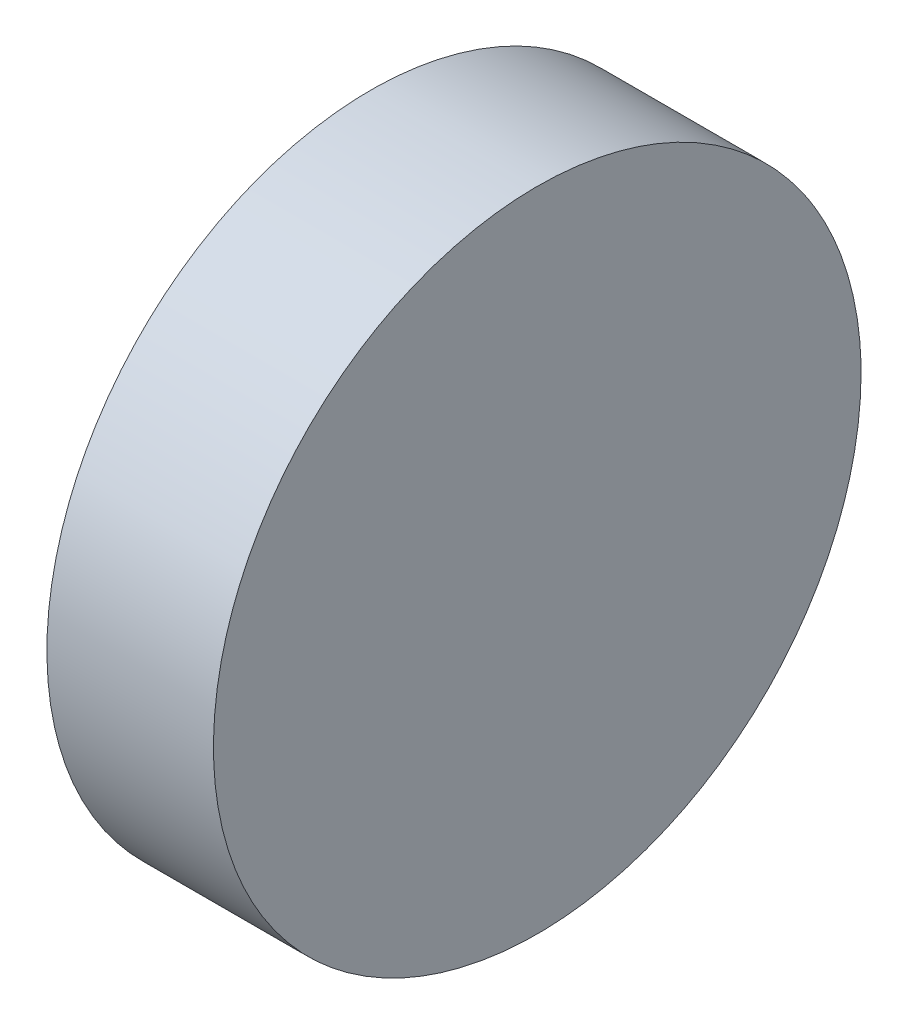
ISO-10303-21;
HEADER;
FILE_DESCRIPTION(('STEP AP214'),'2;1');
FILE_NAME('part.step','',(''),(''),'','','');
FILE_SCHEMA(('AUTOMOTIVE_DESIGN { 1 0 10303 214 1 1 1 1 }'));
ENDSEC;
DATA;
#1=APPLICATION_CONTEXT('core data for automotive mechanical design processes');
#2=APPLICATION_PROTOCOL_DEFINITION('international standard','automotive_design',2000,#1);
#3=PRODUCT_CONTEXT('',#1,'mechanical');
#4=PRODUCT('Part','Part','',(#3));
#5=PRODUCT_RELATED_PRODUCT_CATEGORY('part','',(#4));
#6=PRODUCT_DEFINITION_FORMATION('','',#4);
#7=PRODUCT_DEFINITION_CONTEXT('part definition',#1,'design');
#8=PRODUCT_DEFINITION('design','',#6,#7);
#9=PRODUCT_DEFINITION_SHAPE('','',#8);
#10=(LENGTH_UNIT() NAMED_UNIT(*) SI_UNIT(.MILLI.,.METRE.));
#11=(NAMED_UNIT(*) PLANE_ANGLE_UNIT() SI_UNIT($,.RADIAN.));
#12=(NAMED_UNIT(*) SI_UNIT($,.STERADIAN.) SOLID_ANGLE_UNIT());
#13=UNCERTAINTY_MEASURE_WITH_UNIT(LENGTH_MEASURE(1.E-05),#10,'distance_accuracy_value','');
#14=(GEOMETRIC_REPRESENTATION_CONTEXT(3) GLOBAL_UNCERTAINTY_ASSIGNED_CONTEXT((#13)) GLOBAL_UNIT_ASSIGNED_CONTEXT((#10,
#11,#12)) REPRESENTATION_CONTEXT('',''));
#15=CARTESIAN_POINT('',(0.,0.,0.));
#16=DIRECTION('',(0.,0.,1.));
#17=DIRECTION('',(1.,0.,0.));
#18=AXIS2_PLACEMENT_3D('',#15,#16,#17);
#19=CARTESIAN_POINT('',(24.3378726721836,4.,-17.2853553390593));
#20=CARTESIAN_POINT('',(24.3378726721836,4.16822997920764,-17.2853553390593));
#21=CARTESIAN_POINT('',(24.3378726721836,4.50468993762291,-17.2184292922025));
#22=CARTESIAN_POINT('',(24.3378726721836,4.93254540726843,-16.9325454072684));
#23=CARTESIAN_POINT('',(24.3378726721836,5.21842929220248,-16.5046899376229));
#24=CARTESIAN_POINT('',(24.3378726721836,5.31881836248775,-16.));
#25=CARTESIAN_POINT('',(24.3378726721836,5.21842929220248,-15.4953100623771));
#26=CARTESIAN_POINT('',(24.3378726721836,4.93254540726842,-15.0674545927316));
#27=CARTESIAN_POINT('',(24.3378726721836,4.50468993762291,-14.7815707077975));
#28=CARTESIAN_POINT('',(24.3378726721836,4.,-14.6811816375123));
#29=CARTESIAN_POINT('',(24.3378726721836,3.49531006237708,-14.7815707077975));
#30=CARTESIAN_POINT('',(24.3378726721836,3.06745459273157,-15.0674545927316));
#31=CARTESIAN_POINT('',(24.3378726721836,2.78157070779752,-15.4953100623771));
#32=CARTESIAN_POINT('',(24.3378726721836,2.68118163751224,-16.));
#33=CARTESIAN_POINT('',(24.3378726721836,2.78157070779752,-16.5046899376229));
#34=CARTESIAN_POINT('',(24.3378726721836,3.06745459273157,-16.9325454072684));
#35=CARTESIAN_POINT('',(24.3378726721836,3.49531006237708,-17.2184292922025));
#36=CARTESIAN_POINT('',(24.3378726721836,3.83177002079236,-17.2853553390593));
#37=CARTESIAN_POINT('',(24.3378726721836,4.,-17.2853553390593));
#38=B_SPLINE_CURVE_WITH_KNOTS('',3,(#19,#20,#21,#22,#23,#24,#25,#26,#27,#28,#29,#30,#31,#32,#33,
#34,#35,#36,#37),.UNSPECIFIED.,.T.,.F.,(4,1,1,1,1,1,1,1,1,1,1,1,1,1,1,1,4),(0.,
0.0624999999999996,0.125,0.1875,0.25,0.3125,0.375,0.4375,0.5,0.562499999999999,0.625,0.6875,
0.75,0.8125,0.875,0.937499999999999,1.),.UNSPECIFIED.);
#39=DIRECTION('',(1.,0.,0.));
#40=VECTOR('',#39,1.);
#41=SURFACE_OF_LINEAR_EXTRUSION('',#38,#40);
#42=CARTESIAN_POINT('',(24.3378726721836,4.,-17.2853553390593));
#43=CARTESIAN_POINT('',(24.3378726721836,4.16822997920764,-17.2853553390593));
#44=CARTESIAN_POINT('',(24.3378726721836,4.50468993762291,-17.2184292922025));
#45=CARTESIAN_POINT('',(24.3378726721836,4.93254540726843,-16.9325454072684));
#46=CARTESIAN_POINT('',(24.3378726721836,5.21842929220248,-16.5046899376229));
#47=CARTESIAN_POINT('',(24.3378726721836,5.31881836248775,-16.));
#48=CARTESIAN_POINT('',(24.3378726721836,5.21842929220248,-15.4953100623771));
#49=CARTESIAN_POINT('',(24.3378726721836,4.93254540726842,-15.0674545927316));
#50=CARTESIAN_POINT('',(24.3378726721836,4.50468993762291,-14.7815707077975));
#51=CARTESIAN_POINT('',(24.3378726721836,4.,-14.6811816375123));
#52=CARTESIAN_POINT('',(24.3378726721836,3.49531006237708,-14.7815707077975));
#53=CARTESIAN_POINT('',(24.3378726721836,3.06745459273157,-15.0674545927316));
#54=CARTESIAN_POINT('',(24.3378726721836,2.78157070779752,-15.4953100623771));
#55=CARTESIAN_POINT('',(24.3378726721836,2.68118163751224,-16.));
#56=CARTESIAN_POINT('',(24.3378726721836,2.78157070779752,-16.5046899376229));
#57=CARTESIAN_POINT('',(24.3378726721836,3.06745459273157,-16.9325454072684));
#58=CARTESIAN_POINT('',(24.3378726721836,3.49531006237708,-17.2184292922025));
#59=CARTESIAN_POINT('',(24.3378726721836,3.83177002079236,-17.2853553390593));
#60=CARTESIAN_POINT('',(24.3378726721836,4.,-17.2853553390593));
#61=B_SPLINE_CURVE_WITH_KNOTS('',3,(#42,#43,#44,#45,#46,#47,#48,#49,#50,#51,#52,#53,#54,#55,#56,
#57,#58,#59,#60),.UNSPECIFIED.,.T.,.F.,(4,1,1,1,1,1,1,1,1,1,1,1,1,1,1,1,4),(0.,
0.0624999999999996,0.125,0.1875,0.25,0.3125,0.375,0.4375,0.5,0.562499999999999,0.625,0.6875,
0.75,0.8125,0.875,0.937499999999999,1.),.UNSPECIFIED.);
#62=CARTESIAN_POINT('',(24.3378726721836,4.,-17.2853553390593));
#63=VERTEX_POINT('',#62);
#64=EDGE_CURVE('E10',#63,#63,#61,.T.);
#65=ORIENTED_EDGE('',*,*,#64,.T.);
#66=EDGE_LOOP('',(#65));
#67=FACE_BOUND('',#66,.T.);
#68=CARTESIAN_POINT('',(24.999,4.,-17.2853553390593));
#69=CARTESIAN_POINT('',(24.999,3.97897075641065,-17.2853553542835));
#70=CARTESIAN_POINT('',(24.999,3.95794194930912,-17.2848324564651));
#71=CARTESIAN_POINT('',(24.999,3.91593435304855,-17.2827509520605));
#72=CARTESIAN_POINT('',(24.999,3.894955566905,-17.2811922845425));
#73=CARTESIAN_POINT('',(24.999,3.85309820752038,-17.2770492182821));
#74=CARTESIAN_POINT('',(24.999,3.83221964125572,-17.2744647491513));
#75=CARTESIAN_POINT('',(24.999,3.79061261410211,-17.2682800217817));
#76=CARTESIAN_POINT('',(24.999,3.76988415972655,-17.2646797197333));
#77=CARTESIAN_POINT('',(24.999,3.72862733881625,-17.2564732284894));
#78=CARTESIAN_POINT('',(24.999,3.70809897228152,-17.2518670392939));
#79=CARTESIAN_POINT('',(24.999,3.66729229074795,-17.2416586580684));
#80=CARTESIAN_POINT('',(24.999,3.64701396500219,-17.2360565090061));
#81=CARTESIAN_POINT('',(24.999,3.6067573569788,-17.2238661010483));
#82=CARTESIAN_POINT('',(24.999,3.58677905420612,-17.2172779098512));
#83=CARTESIAN_POINT('',(24.999,3.5471724169556,-17.2031252988193));
#84=CARTESIAN_POINT('',(24.999,3.52754406195848,-17.1955609364383));
#85=CARTESIAN_POINT('',(24.999,3.48868755212148,-17.1794660430837));
#86=CARTESIAN_POINT('',(24.999,3.46945939728158,-17.1709355121101));
#87=CARTESIAN_POINT('',(24.999,3.43144586824002,-17.1529367975247));
#88=CARTESIAN_POINT('',(24.999,3.41266052015493,-17.1434685587776));
#89=CARTESIAN_POINT('',(24.999,3.37557487962463,-17.123622758529));
#90=CARTESIAN_POINT('',(24.999,3.3572746205572,-17.1132451346654));
#91=CARTESIAN_POINT('',(24.999,3.32120152327522,-17.0916088685027));
#92=CARTESIAN_POINT('',(24.999,3.30342870784418,-17.0803501882216));
#93=CARTESIAN_POINT('',(24.999,3.2684528661265,-17.0569800779427));
#94=CARTESIAN_POINT('',(24.999,3.25124983983986,-17.0448686479448));
#95=CARTESIAN_POINT('',(24.999,3.2174559596882,-17.0198212922901));
#96=CARTESIAN_POINT('',(24.999,3.20086507945123,-17.0068854022177));
#97=CARTESIAN_POINT('',(24.999,3.16833789058596,-16.9802173969397));
#98=CARTESIAN_POINT('',(24.999,3.1524015371157,-16.9664853364362));
#99=CARTESIAN_POINT('',(24.999,3.12122574532761,-16.9382532248685));
#100=CARTESIAN_POINT('',(24.999,3.10598626606584,-16.9237532190322));
#101=CARTESIAN_POINT('',(24.999,3.07624678096778,-16.8940137339342));
#102=CARTESIAN_POINT('',(24.999,3.06174677513149,-16.8787742546724));
#103=CARTESIAN_POINT('',(24.999,3.03351466356378,-16.8475984628843));
#104=CARTESIAN_POINT('',(24.999,3.01978260306028,-16.831662109414));
#105=CARTESIAN_POINT('',(24.999,2.99311459778233,-16.7991349205488));
#106=CARTESIAN_POINT('',(24.999,2.98017870770989,-16.7825440403118));
#107=CARTESIAN_POINT('',(24.999,2.95513135205525,-16.7487501601601));
#108=CARTESIAN_POINT('',(24.999,2.94301992205736,-16.7315471338735));
#109=CARTESIAN_POINT('',(24.999,2.9196498117784,-16.6965712921559));
#110=CARTESIAN_POINT('',(24.999,2.90839113149734,-16.6787984767249));
#111=CARTESIAN_POINT('',(24.999,2.88675486533465,-16.6427253794427));
#112=CARTESIAN_POINT('',(24.999,2.87637724147099,-16.6244251203749));
#113=CARTESIAN_POINT('',(24.999,2.85653144122235,-16.5873394798456));
#114=CARTESIAN_POINT('',(24.999,2.84706320247523,-16.5685541317618));
#115=CARTESIAN_POINT('',(24.999,2.82906448789002,-16.5305406027166));
#116=CARTESIAN_POINT('',(24.999,2.82053395691669,-16.5113124478718));
#117=CARTESIAN_POINT('',(24.999,2.80443906356127,-16.4724559380482));
#118=CARTESIAN_POINT('',(24.999,2.79687470117917,-16.4528275830694));
#119=CARTESIAN_POINT('',(24.999,2.78272209015035,-16.4132209457689));
#120=CARTESIAN_POINT('',(24.999,2.77613389895735,-16.3932426429279));
#121=CARTESIAN_POINT('',(24.999,2.76394349098829,-16.3529860350911));
#122=CARTESIAN_POINT('',(24.999,2.75834134191059,-16.3327077096002));
#123=CARTESIAN_POINT('',(24.999,2.74813296072711,-16.2919010273703));
#124=CARTESIAN_POINT('',(24.999,2.74352677158907,-16.2713726598844));
#125=CARTESIAN_POINT('',(24.999,2.73532028018816,-16.2301158415728));
#126=CARTESIAN_POINT('',(24.999,2.7317199779253,-16.2093873907472));
#127=CARTESIAN_POINT('',(24.999,2.72553525114163,-16.1677803538952));
#128=CARTESIAN_POINT('',(24.999,2.72295078281113,-16.1469017743829));
#129=CARTESIAN_POINT('',(24.999,2.71880771436433,-16.1050444511905));
#130=CARTESIAN_POINT('',(24.999,2.7172490438598,-16.0840657144826));
#131=CARTESIAN_POINT('',(24.999,2.71516754761433,-16.0420579831637));
#132=CARTESIAN_POINT('',(24.999,2.71464466094067,-16.0210289915818));
#133=CARTESIAN_POINT('',(24.999,2.71464466094067,-15.9789710084182));
#134=CARTESIAN_POINT('',(24.999,2.71516754761433,-15.9579420168363));
#135=CARTESIAN_POINT('',(24.999,2.7172490438598,-15.9159342855174));
#136=CARTESIAN_POINT('',(24.999,2.71880771436433,-15.8949555488095));
#137=CARTESIAN_POINT('',(24.999,2.72295078281113,-15.8530982256172));
#138=CARTESIAN_POINT('',(24.999,2.72553525114163,-15.8322196461048));
#139=CARTESIAN_POINT('',(24.999,2.7317199779253,-15.7906126092528));
#140=CARTESIAN_POINT('',(24.999,2.73532028018816,-15.7698841584272));
#141=CARTESIAN_POINT('',(24.999,2.74352677158907,-15.7286273401156));
#142=CARTESIAN_POINT('',(24.999,2.74813296072711,-15.7080989726297));
#143=CARTESIAN_POINT('',(24.999,2.75834134191059,-15.6672922903998));
#144=CARTESIAN_POINT('',(24.999,2.76394349098829,-15.6470139649089));
#145=CARTESIAN_POINT('',(24.999,2.77613389895735,-15.6067573570721));
#146=CARTESIAN_POINT('',(24.999,2.78272209015035,-15.5867790542311));
#147=CARTESIAN_POINT('',(24.999,2.79687470117917,-15.5471724169306));
#148=CARTESIAN_POINT('',(24.999,2.80443906356127,-15.5275440619518));
#149=CARTESIAN_POINT('',(24.999,2.82053395691669,-15.4886875521282));
#150=CARTESIAN_POINT('',(24.999,2.82906448789002,-15.4694593972834));
#151=CARTESIAN_POINT('',(24.999,2.84706320247523,-15.4314458682382));
#152=CARTESIAN_POINT('',(24.999,2.85653144122235,-15.4126605201545));
#153=CARTESIAN_POINT('',(24.999,2.87637724147099,-15.3755748796251));
#154=CARTESIAN_POINT('',(24.999,2.88675486533465,-15.3572746205573));
#155=CARTESIAN_POINT('',(24.999,2.90839113149734,-15.3212015232751));
#156=CARTESIAN_POINT('',(24.999,2.9196498117784,-15.3034287078442));
#157=CARTESIAN_POINT('',(24.999,2.94301992205736,-15.2684528661265));
#158=CARTESIAN_POINT('',(24.999,2.95513135205525,-15.2512498398399));
#159=CARTESIAN_POINT('',(24.999,2.98017870770989,-15.2174559596882));
#160=CARTESIAN_POINT('',(24.999,2.99311459778233,-15.2008650794512));
#161=CARTESIAN_POINT('',(24.999,3.01978260306028,-15.168337890586));
#162=CARTESIAN_POINT('',(24.999,3.03351466356377,-15.1524015371157));
#163=CARTESIAN_POINT('',(24.999,3.06174677513149,-15.1212257453276));
#164=CARTESIAN_POINT('',(24.999,3.07624678096778,-15.1059862660659));
#165=CARTESIAN_POINT('',(24.999,3.10598626606584,-15.0762467809678));
#166=CARTESIAN_POINT('',(24.999,3.12122574532761,-15.0617467751315));
#167=CARTESIAN_POINT('',(24.999,3.1524015371157,-15.0335146635638));
#168=CARTESIAN_POINT('',(24.999,3.16833789058596,-15.0197826030603));
#169=CARTESIAN_POINT('',(24.999,3.20086507945122,-14.9931145977823));
#170=CARTESIAN_POINT('',(24.999,3.21745595968819,-14.9801787077099));
#171=CARTESIAN_POINT('',(24.999,3.25124983983987,-14.9551313520553));
#172=CARTESIAN_POINT('',(24.999,3.26845286612653,-14.9430199220574));
#173=CARTESIAN_POINT('',(24.999,3.30342870784415,-14.9196498117784));
#174=CARTESIAN_POINT('',(24.999,3.32120152327509,-14.9083911314974));
#175=CARTESIAN_POINT('',(24.999,3.35727462055733,-14.8867548653347));
#176=CARTESIAN_POINT('',(24.999,3.37557487962511,-14.876377241471));
#177=CARTESIAN_POINT('',(24.999,3.41266052015445,-14.8565314412224));
#178=CARTESIAN_POINT('',(24.999,3.43144586823822,-14.8470632024752));
#179=CARTESIAN_POINT('',(24.999,3.46945939728338,-14.82906448789));
#180=CARTESIAN_POINT('',(24.999,3.48868755212817,-14.8205339569167));
#181=CARTESIAN_POINT('',(24.999,3.52754406195179,-14.8044390635613));
#182=CARTESIAN_POINT('',(24.999,3.54717241693061,-14.7968747011792));
#183=CARTESIAN_POINT('',(24.999,3.58677905423111,-14.7827220901504));
#184=CARTESIAN_POINT('',(24.999,3.60675735707208,-14.7761338989574));
#185=CARTESIAN_POINT('',(24.999,3.64701396490891,-14.7639434909883));
#186=CARTESIAN_POINT('',(24.999,3.66729229039981,-14.7583413419106));
#187=CARTESIAN_POINT('',(24.999,3.70809897262967,-14.7481329607271));
#188=CARTESIAN_POINT('',(24.999,3.72862734011562,-14.7435267715891));
#189=CARTESIAN_POINT('',(24.999,3.76988415842718,-14.7353202801882));
#190=CARTESIAN_POINT('',(24.999,3.79061260925278,-14.7317199779253));
#191=CARTESIAN_POINT('',(24.999,3.83221964610483,-14.7255352511417));
#192=CARTESIAN_POINT('',(24.999,3.85309822561715,-14.7229507828111));
#193=CARTESIAN_POINT('',(24.999,3.89495554880947,-14.7188077143643));
#194=CARTESIAN_POINT('',(24.999,3.91593428551736,-14.7172490438598));
#195=CARTESIAN_POINT('',(24.999,3.95794201683633,-14.7151675476143));
#196=CARTESIAN_POINT('',(24.999,3.97897100841816,-14.7146446609407));
#197=CARTESIAN_POINT('',(24.999,4.02102899158183,-14.7146446609407));
#198=CARTESIAN_POINT('',(24.999,4.04205798316366,-14.7151675476143));
#199=CARTESIAN_POINT('',(24.999,4.08406571448263,-14.7172490438598));
#200=CARTESIAN_POINT('',(24.999,4.10504445119053,-14.7188077143643));
#201=CARTESIAN_POINT('',(24.999,4.14690177438284,-14.7229507828111));
#202=CARTESIAN_POINT('',(24.999,4.16778035389516,-14.7255352511416));
#203=CARTESIAN_POINT('',(24.999,4.20938739074721,-14.7317199779253));
#204=CARTESIAN_POINT('',(24.999,4.23011584157282,-14.7353202801882));
#205=CARTESIAN_POINT('',(24.999,4.27137265988437,-14.7435267715891));
#206=CARTESIAN_POINT('',(24.999,4.29190102737032,-14.7481329607271));
#207=CARTESIAN_POINT('',(24.999,4.33270770960018,-14.7583413419106));
#208=CARTESIAN_POINT('',(24.999,4.35298603509108,-14.7639434909883));
#209=CARTESIAN_POINT('',(24.999,4.39324264292792,-14.7761338989574));
#210=CARTESIAN_POINT('',(24.999,4.41322094576888,-14.7827220901504));
#211=CARTESIAN_POINT('',(24.999,4.45282758306938,-14.7968747011792));
#212=CARTESIAN_POINT('',(24.999,4.47245593804821,-14.8044390635613));
#213=CARTESIAN_POINT('',(24.999,4.51131244787182,-14.8205339569167));
#214=CARTESIAN_POINT('',(24.999,4.53054060271661,-14.82906448789));
#215=CARTESIAN_POINT('',(24.999,4.56855413176177,-14.8470632024752));
#216=CARTESIAN_POINT('',(24.999,4.58733947984554,-14.8565314412224));
#217=CARTESIAN_POINT('',(24.999,4.62442512037489,-14.876377241471));
#218=CARTESIAN_POINT('',(24.999,4.64272537944267,-14.8867548653347));
#219=CARTESIAN_POINT('',(24.999,4.6787984767249,-14.9083911314973));
#220=CARTESIAN_POINT('',(24.999,4.69657129215585,-14.9196498117784));
#221=CARTESIAN_POINT('',(24.999,4.73154713387346,-14.9430199220574));
#222=CARTESIAN_POINT('',(24.999,4.74875016016012,-14.9551313520553));
#223=CARTESIAN_POINT('',(24.999,4.78254404031181,-14.9801787077099));
#224=CARTESIAN_POINT('',(24.999,4.79913492054877,-14.9931145977823));
#225=CARTESIAN_POINT('',(24.999,4.83166210941403,-15.0197826030603));
#226=CARTESIAN_POINT('',(24.999,4.84759846288429,-15.0335146635638));
#227=CARTESIAN_POINT('',(24.999,4.87877425467239,-15.0617467751315));
#228=CARTESIAN_POINT('',(24.999,4.89401373393415,-15.0762467809678));
#229=CARTESIAN_POINT('',(24.999,4.92375321903221,-15.1059862660659));
#230=CARTESIAN_POINT('',(24.999,4.9382532248685,-15.1212257453276));
#231=CARTESIAN_POINT('',(24.999,4.96648533643622,-15.1524015371157));
#232=CARTESIAN_POINT('',(24.999,4.98021739693971,-15.168337890586));
#233=CARTESIAN_POINT('',(24.999,5.00688540221766,-15.2008650794512));
#234=CARTESIAN_POINT('',(24.999,5.0198212922901,-15.2174559596882));
#235=CARTESIAN_POINT('',(24.999,5.04486864794475,-15.2512498398399));
#236=CARTESIAN_POINT('',(24.999,5.05698007794264,-15.2684528661265));
#237=CARTESIAN_POINT('',(24.999,5.08035018822159,-15.3034287078442));
#238=CARTESIAN_POINT('',(24.999,5.09160886850265,-15.3212015232751));
#239=CARTESIAN_POINT('',(24.999,5.11324513466534,-15.3572746205573));
#240=CARTESIAN_POINT('',(24.999,5.123622758529,-15.3755748796251));
#241=CARTESIAN_POINT('',(24.999,5.14346855877764,-15.4126605201545));
#242=CARTESIAN_POINT('',(24.999,5.15293679752476,-15.4314458682382));
#243=CARTESIAN_POINT('',(24.999,5.17093551210997,-15.4694593972834));
#244=CARTESIAN_POINT('',(24.999,5.1794660430833,-15.4886875521282));
#245=CARTESIAN_POINT('',(24.999,5.19556093643873,-15.5275440619518));
#246=CARTESIAN_POINT('',(24.999,5.20312529882082,-15.5471724169306));
#247=CARTESIAN_POINT('',(24.999,5.21727790984964,-15.5867790542311));
#248=CARTESIAN_POINT('',(24.999,5.22386610104264,-15.6067573570721));
#249=CARTESIAN_POINT('',(24.999,5.2360565090117,-15.6470139649089));
#250=CARTESIAN_POINT('',(24.999,5.2416586580894,-15.6672922903998));
#251=CARTESIAN_POINT('',(24.999,5.25186703927288,-15.7080989726297));
#252=CARTESIAN_POINT('',(24.999,5.25647322841093,-15.7286273401156));
#253=CARTESIAN_POINT('',(24.999,5.26467971981183,-15.7698841584272));
#254=CARTESIAN_POINT('',(24.999,5.26828002207469,-15.7906126092528));
#255=CARTESIAN_POINT('',(24.999,5.27446474885836,-15.8322196461049));
#256=CARTESIAN_POINT('',(24.999,5.27704921718887,-15.8530982256172));
#257=CARTESIAN_POINT('',(24.999,5.28119228563567,-15.8949555488095));
#258=CARTESIAN_POINT('',(24.999,5.28275095614019,-15.9159342855174));
#259=CARTESIAN_POINT('',(24.999,5.28483245238567,-15.9579420168363));
#260=CARTESIAN_POINT('',(24.999,5.28535533905933,-15.9789710084182));
#261=CARTESIAN_POINT('',(24.999,5.28535533905933,-16.0210289915818));
#262=CARTESIAN_POINT('',(24.999,5.28483245238567,-16.0420579831637));
#263=CARTESIAN_POINT('',(24.999,5.28275095614019,-16.0840657144827));
#264=CARTESIAN_POINT('',(24.999,5.28119228563567,-16.1050444511905));
#265=CARTESIAN_POINT('',(24.999,5.27704921718887,-16.1469017743829));
#266=CARTESIAN_POINT('',(24.999,5.27446474885836,-16.1677803538952));
#267=CARTESIAN_POINT('',(24.999,5.26828002207469,-16.2093873907472));
#268=CARTESIAN_POINT('',(24.999,5.26467971981183,-16.2301158415728));
#269=CARTESIAN_POINT('',(24.999,5.25647322841093,-16.2713726598844));
#270=CARTESIAN_POINT('',(24.999,5.25186703927288,-16.2919010273703));
#271=CARTESIAN_POINT('',(24.999,5.2416586580894,-16.3327077096002));
#272=CARTESIAN_POINT('',(24.999,5.2360565090117,-16.3529860350911));
#273=CARTESIAN_POINT('',(24.999,5.22386610104264,-16.3932426429279));
#274=CARTESIAN_POINT('',(24.999,5.21727790984964,-16.4132209457689));
#275=CARTESIAN_POINT('',(24.999,5.20312529882082,-16.4528275830694));
#276=CARTESIAN_POINT('',(24.999,5.19556093643873,-16.4724559380482));
#277=CARTESIAN_POINT('',(24.999,5.1794660430833,-16.5113124478718));
#278=CARTESIAN_POINT('',(24.999,5.17093551210997,-16.5305406027166));
#279=CARTESIAN_POINT('',(24.999,5.15293679752476,-16.5685541317618));
#280=CARTESIAN_POINT('',(24.999,5.14346855877765,-16.5873394798456));
#281=CARTESIAN_POINT('',(24.999,5.123622758529,-16.6244251203749));
#282=CARTESIAN_POINT('',(24.999,5.11324513466534,-16.6427253794427));
#283=CARTESIAN_POINT('',(24.999,5.09160886850265,-16.6787984767249));
#284=CARTESIAN_POINT('',(24.999,5.08035018822159,-16.6965712921559));
#285=CARTESIAN_POINT('',(24.999,5.05698007794264,-16.7315471338735));
#286=CARTESIAN_POINT('',(24.999,5.04486864794475,-16.7487501601601));
#287=CARTESIAN_POINT('',(24.999,5.0198212922901,-16.7825440403118));
#288=CARTESIAN_POINT('',(24.999,5.00688540221766,-16.7991349205488));
#289=CARTESIAN_POINT('',(24.999,4.98021739693971,-16.831662109414));
#290=CARTESIAN_POINT('',(24.999,4.96648533643622,-16.8475984628843));
#291=CARTESIAN_POINT('',(24.999,4.9382532248685,-16.8787742546724));
#292=CARTESIAN_POINT('',(24.999,4.92375321903221,-16.8940137339342));
#293=CARTESIAN_POINT('',(24.999,4.89401373393415,-16.9237532190322));
#294=CARTESIAN_POINT('',(24.999,4.87877425467239,-16.9382532248685));
#295=CARTESIAN_POINT('',(24.999,4.84759846288429,-16.9664853364362));
#296=CARTESIAN_POINT('',(24.999,4.83166210941403,-16.9802173969397));
#297=CARTESIAN_POINT('',(24.999,4.79913492054877,-17.0068854022177));
#298=CARTESIAN_POINT('',(24.999,4.7825440403118,-17.0198212922901));
#299=CARTESIAN_POINT('',(24.999,4.74875016016014,-17.0448686479448));
#300=CARTESIAN_POINT('',(24.999,4.73154713387349,-17.0569800779427));
#301=CARTESIAN_POINT('',(24.999,4.69657129215581,-17.0803501882216));
#302=CARTESIAN_POINT('',(24.999,4.67879847672477,-17.0916088685027));
#303=CARTESIAN_POINT('',(24.999,4.64272537944279,-17.1132451346654));
#304=CARTESIAN_POINT('',(24.999,4.62442512037537,-17.123622758529));
#305=CARTESIAN_POINT('',(24.999,4.58733947984506,-17.1434685587776));
#306=CARTESIAN_POINT('',(24.999,4.56855413175998,-17.1529367975247));
#307=CARTESIAN_POINT('',(24.999,4.53054060271841,-17.1709355121101));
#308=CARTESIAN_POINT('',(24.999,4.51131244787852,-17.1794660430837));
#309=CARTESIAN_POINT('',(24.999,4.47245593804151,-17.1955609364383));
#310=CARTESIAN_POINT('',(24.999,4.45282758304439,-17.2031252988193));
#311=CARTESIAN_POINT('',(24.999,4.41322094579387,-17.2172779098512));
#312=CARTESIAN_POINT('',(24.999,4.39324264302119,-17.2238661010483));
#313=CARTESIAN_POINT('',(24.999,4.3529860349978,-17.2360565090061));
#314=CARTESIAN_POINT('',(24.999,4.33270770925204,-17.2416586580684));
#315=CARTESIAN_POINT('',(24.999,4.29190102771848,-17.2518670392939));
#316=CARTESIAN_POINT('',(24.999,4.27137266118374,-17.2564732284894));
#317=CARTESIAN_POINT('',(24.999,4.23011584027345,-17.2646797197333));
#318=CARTESIAN_POINT('',(24.999,4.20938738589789,-17.2682800217817));
#319=CARTESIAN_POINT('',(24.999,4.16778035874427,-17.2744647491513));
#320=CARTESIAN_POINT('',(24.999,4.14690179247962,-17.2770492182821));
#321=CARTESIAN_POINT('',(24.999,4.105044433095,-17.2811922845425));
#322=CARTESIAN_POINT('',(24.999,4.08406564695145,-17.2827509520605));
#323=CARTESIAN_POINT('',(24.999,4.04205805069088,-17.2848324564651));
#324=CARTESIAN_POINT('',(24.999,4.02102924358934,-17.2853553542836));
#325=CARTESIAN_POINT('',(24.999,4.,-17.2853553390593));
#326=B_SPLINE_CURVE_WITH_KNOTS('',3,(#68,#69,#70,#71,#72,#73,#74,#75,#76,#77,#78,#79,#80,#81,
#82,#83,#84,#85,#86,#87,#88,#89,#90,#91,#92,#93,#94,#95,#96,#97,#98,#99,#100,#101,#102,#103,
#104,#105,#106,#107,#108,#109,#110,#111,#112,#113,#114,#115,#116,#117,#118,#119,#120,#121,#122,
#123,#124,#125,#126,#127,#128,#129,#130,#131,#132,#133,#134,#135,#136,#137,#138,#139,#140,#141,
#142,#143,#144,#145,#146,#147,#148,#149,#150,#151,#152,#153,#154,#155,#156,#157,#158,#159,#160,
#161,#162,#163,#164,#165,#166,#167,#168,#169,#170,#171,#172,#173,#174,#175,#176,#177,#178,#179,
#180,#181,#182,#183,#184,#185,#186,#187,#188,#189,#190,#191,#192,#193,#194,#195,#196,#197,#198,
#199,#200,#201,#202,#203,#204,#205,#206,#207,#208,#209,#210,#211,#212,#213,#214,#215,#216,#217,
#218,#219,#220,#221,#222,#223,#224,#225,#226,#227,#228,#229,#230,#231,#232,#233,#234,#235,#236,
#237,#238,#239,#240,#241,#242,#243,#244,#245,#246,#247,#248,#249,#250,#251,#252,#253,#254,#255,
#256,#257,#258,#259,#260,#261,#262,#263,#264,#265,#266,#267,#268,#269,#270,#271,#272,#273,#274,
#275,#276,#277,#278,#279,#280,#281,#282,#283,#284,#285,#286,#287,#288,#289,#290,#291,#292,#293,
#294,#295,#296,#297,#298,#299,#300,#301,#302,#303,#304,#305,#306,#307,#308,#309,#310,#311,#312,
#313,#314,#315,#316,#317,#318,#319,#320,#321,#322,#323,#324,#325),.UNSPECIFIED.,.F.,.F.,(4,2,2,
2,2,2,2,2,2,2,2,2,2,2,2,2,2,2,2,2,2,2,2,2,2,2,2,2,2,2,2,2,2,2,2,2,2,2,2,2,2,2,2,2,2,2,2,2,2,2,2,
2,2,2,2,2,2,2,2,2,2,2,2,2,2,2,2,2,2,2,2,2,2,2,2,2,2,2,2,2,2,2,2,2,2,2,2,2,2,2,2,2,2,2,2,2,2,2,2,
2,2,2,2,2,2,2,2,2,2,2,2,2,2,2,2,2,2,2,2,2,2,2,2,2,2,2,2,2,4),(0.,0.0630806127990775,
0.12616493680959,0.189253590290848,0.252344965001655,0.315436339712461,0.37852499319372,
0.441609317204231,0.50468993000331,0.567770542802387,0.6308548668129,0.693943520294159,
0.757034895004964,0.820126269715771,0.883214923197031,0.946299247207541,1.00937986000662,
1.0724604728057,1.13554479681621,1.19863345029747,1.26172482500828,1.32481619971908,
1.38790485320034,1.45098917721085,1.51406979000993,1.57715040280901,1.64023472681952,
1.70332338030078,1.76641475501158,1.82950612972239,1.89259478320365,1.95567910721416,
2.01875972001324,2.08184033281232,2.14492465682283,2.20801331030409,2.2711046850149,
2.3341960597257,2.39728471320696,2.46036903721747,2.52344965001655,2.58653026281563,
2.64961458682614,2.7127032403074,2.77579461501821,2.83888598972901,2.90197464321027,
2.96505896722078,3.02813958001986,3.09122019281894,3.15430451682945,3.21739317031071,
3.28048454502151,3.34357591973232,3.40666457321358,3.46974889722409,3.53282951002317,
3.59591012282225,3.65899444683276,3.72208310031402,3.78517447502482,3.84826584973563,
3.91135450321689,3.9744388272274,4.03751944002648,4.10060005282556,4.16368437683607,
4.22677303031732,4.28986440502813,4.35295577973894,4.4160444332202,4.47912875723071,
4.54220937002979,4.60528998282886,4.66837430683937,4.73146296032063,4.79455433503144,
4.85764570974225,4.9207343632235,4.98381868723402,5.0468993000331,5.10997991283217,
5.17306423684269,5.23615289032394,5.29924426503475,5.36233563974556,5.42542429322682,
5.48850861723733,5.5515892300364,5.61466984283549,5.677754166846,5.74084282032726,
5.80393419503807,5.86702556974887,5.93011422323013,5.99319854724064,6.05627916003972,
6.1193597728388,6.18244409684931,6.24553275033057,6.30862412504137,6.37171549975218,
6.43480415323344,6.49788847724395,6.56096909004303,6.62404970284211,6.68713402685262,
6.75022268033388,6.81331405504469,6.87640542975549,6.93949408323675,7.00257840724726,
7.06565902004634,7.12873963284542,7.19182395685593,7.25491261033719,7.31800398504799,
7.3810953597588,7.44418401324006,7.50726833725057,7.57034895004965,7.63342956284872,
7.69651388685924,7.75960254034049,7.8226939150513,7.88578528976211,7.94887394324337,
8.01195826725388,8.07503888005296),.UNSPECIFIED.);
#327=CARTESIAN_POINT('',(24.999,4.,-17.2853553390593));
#328=VERTEX_POINT('',#327);
#329=EDGE_CURVE('E25',#328,#328,#326,.F.);
#330=ORIENTED_EDGE('',*,*,#329,.F.);
#331=EDGE_LOOP('',(#330));
#332=FACE_BOUND('',#331,.T.);
#333=ADVANCED_FACE('F15',(#67,#332),#41,.T.);
#334=CARTESIAN_POINT('',(24.3378726721836,38.7605359730097,-3.00738998868599));
#335=DIRECTION('',(1.,0.,0.));
#336=DIRECTION('',(0.,1.,0.));
#337=AXIS2_PLACEMENT_3D('',#334,#335,#336);
#338=PLANE('',#337);
#339=ORIENTED_EDGE('',*,*,#64,.F.);
#340=EDGE_LOOP('',(#339));
#341=FACE_BOUND('',#340,.T.);
#342=ADVANCED_FACE('F63',(#341),#338,.F.);
#343=CARTESIAN_POINT('',(24.999,38.7605359730097,-3.00738998868599));
#344=DIRECTION('',(1.,0.,0.));
#345=DIRECTION('',(0.,1.,0.));
#346=AXIS2_PLACEMENT_3D('',#343,#344,#345);
#347=PLANE('',#346);
#348=ORIENTED_EDGE('',*,*,#329,.T.);
#349=EDGE_LOOP('',(#348));
#350=FACE_BOUND('',#349,.T.);
#351=ADVANCED_FACE('F32',(#350),#347,.T.);
#352=CLOSED_SHELL('',(#333,#342,#351));
#353=MANIFOLD_SOLID_BREP('B1',#352);
#354=ADVANCED_BREP_SHAPE_REPRESENTATION('',(#18,#353),#14);
#355=SHAPE_DEFINITION_REPRESENTATION(#9,#354);
ENDSEC;
END-ISO-10303-21;
